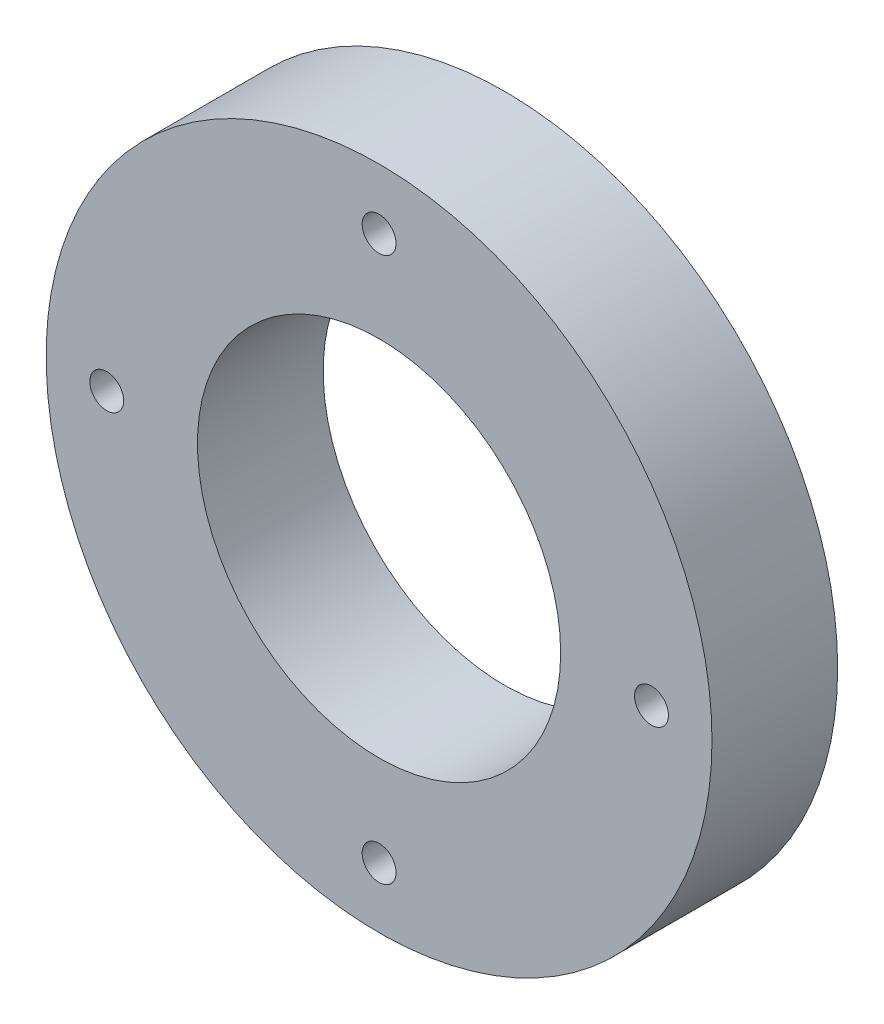
ISO-10303-21;
HEADER;
FILE_DESCRIPTION(('STEP AP214'),'2;1');
FILE_NAME('part.step','',(''),(''),'','','');
FILE_SCHEMA(('AUTOMOTIVE_DESIGN { 1 0 10303 214 1 1 1 1 }'));
ENDSEC;
DATA;
#1=APPLICATION_CONTEXT('core data for automotive mechanical design processes');
#2=APPLICATION_PROTOCOL_DEFINITION('international standard','automotive_design',2000,#1);
#3=PRODUCT_CONTEXT('',#1,'mechanical');
#4=PRODUCT('Part','Part','',(#3));
#5=PRODUCT_RELATED_PRODUCT_CATEGORY('part','',(#4));
#6=PRODUCT_DEFINITION_FORMATION('','',#4);
#7=PRODUCT_DEFINITION_CONTEXT('part definition',#1,'design');
#8=PRODUCT_DEFINITION('design','',#6,#7);
#9=PRODUCT_DEFINITION_SHAPE('','',#8);
#10=(LENGTH_UNIT() NAMED_UNIT(*) SI_UNIT(.MILLI.,.METRE.));
#11=(NAMED_UNIT(*) PLANE_ANGLE_UNIT() SI_UNIT($,.RADIAN.));
#12=(NAMED_UNIT(*) SI_UNIT($,.STERADIAN.) SOLID_ANGLE_UNIT());
#13=UNCERTAINTY_MEASURE_WITH_UNIT(LENGTH_MEASURE(1.E-05),#10,'distance_accuracy_value','');
#14=(GEOMETRIC_REPRESENTATION_CONTEXT(3) GLOBAL_UNCERTAINTY_ASSIGNED_CONTEXT((#13)) GLOBAL_UNIT_ASSIGNED_CONTEXT((#10,
#11,#12)) REPRESENTATION_CONTEXT('',''));
#15=CARTESIAN_POINT('',(0.,0.,0.));
#16=DIRECTION('',(0.,0.,1.));
#17=DIRECTION('',(1.,0.,0.));
#18=AXIS2_PLACEMENT_3D('',#15,#16,#17);
#19=CARTESIAN_POINT('',(0.,0.,13.1826));
#20=DIRECTION('',(0.,0.,1.));
#21=DIRECTION('',(1.,0.,0.));
#22=AXIS2_PLACEMENT_3D('',#19,#20,#21);
#23=PLANE('',#22);
#24=CARTESIAN_POINT('',(0.,-28.575,13.1826));
#25=DIRECTION('',(0.,0.,1.));
#26=DIRECTION('',(1.,0.,0.));
#27=AXIS2_PLACEMENT_3D('',#24,#25,#26);
#28=CIRCLE('',#27,1.778);
#29=CARTESIAN_POINT('',(1.778,-28.575,13.1826));
#30=VERTEX_POINT('',#29);
#31=EDGE_CURVE('E59',#30,#30,#28,.T.);
#32=ORIENTED_EDGE('',*,*,#31,.F.);
#33=EDGE_LOOP('',(#32));
#34=FACE_BOUND('',#33,.T.);
#35=CARTESIAN_POINT('',(0.,0.,13.1826));
#36=DIRECTION('',(0.,0.,1.));
#37=DIRECTION('',(1.,0.,0.));
#38=AXIS2_PLACEMENT_3D('',#35,#36,#37);
#39=CIRCLE('',#38,19.05);
#40=CARTESIAN_POINT('',(19.05,0.,13.1826));
#41=VERTEX_POINT('',#40);
#42=EDGE_CURVE('E47',#41,#41,#39,.T.);
#43=ORIENTED_EDGE('',*,*,#42,.F.);
#44=EDGE_LOOP('',(#43));
#45=FACE_BOUND('',#44,.T.);
#46=CARTESIAN_POINT('',(0.,0.,13.1826));
#47=DIRECTION('',(0.,0.,1.));
#48=DIRECTION('',(1.,0.,0.));
#49=AXIS2_PLACEMENT_3D('',#46,#47,#48);
#50=CIRCLE('',#49,34.925);
#51=CARTESIAN_POINT('',(34.925,0.,13.1826));
#52=VERTEX_POINT('',#51);
#53=EDGE_CURVE('E10',#52,#52,#50,.T.);
#54=ORIENTED_EDGE('',*,*,#53,.T.);
#55=EDGE_LOOP('',(#54));
#56=FACE_BOUND('',#55,.T.);
#57=CARTESIAN_POINT('',(0.,28.575,13.1826));
#58=DIRECTION('',(0.,0.,1.));
#59=DIRECTION('',(1.,0.,0.));
#60=AXIS2_PLACEMENT_3D('',#57,#58,#59);
#61=CIRCLE('',#60,1.778);
#62=CARTESIAN_POINT('',(1.778,28.575,13.1826));
#63=VERTEX_POINT('',#62);
#64=EDGE_CURVE('E42',#63,#63,#61,.T.);
#65=ORIENTED_EDGE('',*,*,#64,.F.);
#66=EDGE_LOOP('',(#65));
#67=FACE_BOUND('',#66,.T.);
#68=CARTESIAN_POINT('',(28.575,0.,13.1826));
#69=DIRECTION('',(0.,0.,1.));
#70=DIRECTION('',(1.,0.,0.));
#71=AXIS2_PLACEMENT_3D('',#68,#69,#70);
#72=CIRCLE('',#71,1.778);
#73=CARTESIAN_POINT('',(30.353,0.,13.1826));
#74=VERTEX_POINT('',#73);
#75=EDGE_CURVE('E53',#74,#74,#72,.T.);
#76=ORIENTED_EDGE('',*,*,#75,.F.);
#77=EDGE_LOOP('',(#76));
#78=FACE_BOUND('',#77,.T.);
#79=CARTESIAN_POINT('',(-28.575,0.,13.1826));
#80=DIRECTION('',(0.,0.,1.));
#81=DIRECTION('',(1.,0.,0.));
#82=AXIS2_PLACEMENT_3D('',#79,#80,#81);
#83=CIRCLE('',#82,1.77800000000001);
#84=CARTESIAN_POINT('',(-26.797,0.,13.1826));
#85=VERTEX_POINT('',#84);
#86=EDGE_CURVE('E65',#85,#85,#83,.T.);
#87=ORIENTED_EDGE('',*,*,#86,.F.);
#88=EDGE_LOOP('',(#87));
#89=FACE_BOUND('',#88,.T.);
#90=ADVANCED_FACE('F31',(#34,#45,#56,#67,#78,#89),#23,.T.);
#91=CARTESIAN_POINT('',(0.,0.,0.));
#92=DIRECTION('',(0.,0.,1.));
#93=DIRECTION('',(1.,0.,0.));
#94=AXIS2_PLACEMENT_3D('',#91,#92,#93);
#95=PLANE('',#94);
#96=CARTESIAN_POINT('',(0.,-28.575,0.));
#97=DIRECTION('',(0.,0.,1.));
#98=DIRECTION('',(1.,0.,0.));
#99=AXIS2_PLACEMENT_3D('',#96,#97,#98);
#100=CIRCLE('',#99,1.778);
#101=CARTESIAN_POINT('',(1.778,-28.575,0.));
#102=VERTEX_POINT('',#101);
#103=EDGE_CURVE('E62',#102,#102,#100,.T.);
#104=ORIENTED_EDGE('',*,*,#103,.T.);
#105=EDGE_LOOP('',(#104));
#106=FACE_BOUND('',#105,.T.);
#107=CARTESIAN_POINT('',(0.,0.,0.));
#108=DIRECTION('',(0.,0.,1.));
#109=DIRECTION('',(1.,0.,0.));
#110=AXIS2_PLACEMENT_3D('',#107,#108,#109);
#111=CIRCLE('',#110,19.05);
#112=CARTESIAN_POINT('',(19.05,0.,0.));
#113=VERTEX_POINT('',#112);
#114=EDGE_CURVE('E50',#113,#113,#111,.T.);
#115=ORIENTED_EDGE('',*,*,#114,.T.);
#116=EDGE_LOOP('',(#115));
#117=FACE_BOUND('',#116,.T.);
#118=CARTESIAN_POINT('',(0.,0.,0.));
#119=DIRECTION('',(0.,0.,1.));
#120=DIRECTION('',(1.,0.,0.));
#121=AXIS2_PLACEMENT_3D('',#118,#119,#120);
#122=CIRCLE('',#121,34.925);
#123=CARTESIAN_POINT('',(34.925,0.,0.));
#124=VERTEX_POINT('',#123);
#125=EDGE_CURVE('E35',#124,#124,#122,.T.);
#126=ORIENTED_EDGE('',*,*,#125,.F.);
#127=EDGE_LOOP('',(#126));
#128=FACE_BOUND('',#127,.T.);
#129=CARTESIAN_POINT('',(0.,28.575,0.));
#130=DIRECTION('',(0.,0.,1.));
#131=DIRECTION('',(1.,0.,0.));
#132=AXIS2_PLACEMENT_3D('',#129,#130,#131);
#133=CIRCLE('',#132,1.778);
#134=CARTESIAN_POINT('',(1.778,28.575,0.));
#135=VERTEX_POINT('',#134);
#136=EDGE_CURVE('E44',#135,#135,#133,.T.);
#137=ORIENTED_EDGE('',*,*,#136,.T.);
#138=EDGE_LOOP('',(#137));
#139=FACE_BOUND('',#138,.T.);
#140=CARTESIAN_POINT('',(28.575,0.,0.));
#141=DIRECTION('',(0.,0.,1.));
#142=DIRECTION('',(1.,0.,0.));
#143=AXIS2_PLACEMENT_3D('',#140,#141,#142);
#144=CIRCLE('',#143,1.778);
#145=CARTESIAN_POINT('',(30.353,0.,0.));
#146=VERTEX_POINT('',#145);
#147=EDGE_CURVE('E56',#146,#146,#144,.T.);
#148=ORIENTED_EDGE('',*,*,#147,.T.);
#149=EDGE_LOOP('',(#148));
#150=FACE_BOUND('',#149,.T.);
#151=CARTESIAN_POINT('',(-28.575,0.,0.));
#152=DIRECTION('',(0.,0.,1.));
#153=DIRECTION('',(1.,0.,0.));
#154=AXIS2_PLACEMENT_3D('',#151,#152,#153);
#155=CIRCLE('',#154,1.77800000000001);
#156=CARTESIAN_POINT('',(-26.797,0.,0.));
#157=VERTEX_POINT('',#156);
#158=EDGE_CURVE('E68',#157,#157,#155,.T.);
#159=ORIENTED_EDGE('',*,*,#158,.T.);
#160=EDGE_LOOP('',(#159));
#161=FACE_BOUND('',#160,.T.);
#162=ADVANCED_FACE('F78',(#106,#117,#128,#139,#150,#161),#95,.F.);
#163=CARTESIAN_POINT('',(0.,0.,13.1826));
#164=DIRECTION('',(0.,0.,-1.));
#165=DIRECTION('',(-1.,0.,0.));
#166=AXIS2_PLACEMENT_3D('',#163,#164,#165);
#167=CYLINDRICAL_SURFACE('',#166,34.925);
#168=ORIENTED_EDGE('',*,*,#53,.F.);
#169=EDGE_LOOP('',(#168));
#170=FACE_BOUND('',#169,.T.);
#171=ORIENTED_EDGE('',*,*,#125,.T.);
#172=EDGE_LOOP('',(#171));
#173=FACE_BOUND('',#172,.T.);
#174=ADVANCED_FACE('F33',(#170,#173),#167,.T.);
#175=CARTESIAN_POINT('',(0.,28.575,13.1826));
#176=DIRECTION('',(0.,0.,-1.));
#177=DIRECTION('',(-1.,0.,0.));
#178=AXIS2_PLACEMENT_3D('',#175,#176,#177);
#179=CYLINDRICAL_SURFACE('',#178,1.778);
#180=ORIENTED_EDGE('',*,*,#64,.T.);
#181=EDGE_LOOP('',(#180));
#182=FACE_BOUND('',#181,.T.);
#183=ORIENTED_EDGE('',*,*,#136,.F.);
#184=EDGE_LOOP('',(#183));
#185=FACE_BOUND('',#184,.T.);
#186=ADVANCED_FACE('F88',(#182,#185),#179,.F.);
#187=CARTESIAN_POINT('',(0.,0.,13.1826));
#188=DIRECTION('',(0.,0.,-1.));
#189=DIRECTION('',(-1.,0.,0.));
#190=AXIS2_PLACEMENT_3D('',#187,#188,#189);
#191=CYLINDRICAL_SURFACE('',#190,19.05);
#192=ORIENTED_EDGE('',*,*,#42,.T.);
#193=EDGE_LOOP('',(#192));
#194=FACE_BOUND('',#193,.T.);
#195=ORIENTED_EDGE('',*,*,#114,.F.);
#196=EDGE_LOOP('',(#195));
#197=FACE_BOUND('',#196,.T.);
#198=ADVANCED_FACE('F91',(#194,#197),#191,.F.);
#199=CARTESIAN_POINT('',(28.575,0.,13.1826));
#200=DIRECTION('',(0.,0.,-1.));
#201=DIRECTION('',(-1.,0.,0.));
#202=AXIS2_PLACEMENT_3D('',#199,#200,#201);
#203=CYLINDRICAL_SURFACE('',#202,1.778);
#204=ORIENTED_EDGE('',*,*,#75,.T.);
#205=EDGE_LOOP('',(#204));
#206=FACE_BOUND('',#205,.T.);
#207=ORIENTED_EDGE('',*,*,#147,.F.);
#208=EDGE_LOOP('',(#207));
#209=FACE_BOUND('',#208,.T.);
#210=ADVANCED_FACE('F95',(#206,#209),#203,.F.);
#211=CARTESIAN_POINT('',(0.,-28.575,13.1826));
#212=DIRECTION('',(0.,0.,-1.));
#213=DIRECTION('',(-1.,0.,0.));
#214=AXIS2_PLACEMENT_3D('',#211,#212,#213);
#215=CYLINDRICAL_SURFACE('',#214,1.778);
#216=ORIENTED_EDGE('',*,*,#31,.T.);
#217=EDGE_LOOP('',(#216));
#218=FACE_BOUND('',#217,.T.);
#219=ORIENTED_EDGE('',*,*,#103,.F.);
#220=EDGE_LOOP('',(#219));
#221=FACE_BOUND('',#220,.T.);
#222=ADVANCED_FACE('F99',(#218,#221),#215,.F.);
#223=CARTESIAN_POINT('',(-28.575,0.,13.1826));
#224=DIRECTION('',(0.,0.,-1.));
#225=DIRECTION('',(-1.,0.,0.));
#226=AXIS2_PLACEMENT_3D('',#223,#224,#225);
#227=CYLINDRICAL_SURFACE('',#226,1.77800000000001);
#228=ORIENTED_EDGE('',*,*,#86,.T.);
#229=EDGE_LOOP('',(#228));
#230=FACE_BOUND('',#229,.T.);
#231=ORIENTED_EDGE('',*,*,#158,.F.);
#232=EDGE_LOOP('',(#231));
#233=FACE_BOUND('',#232,.T.);
#234=ADVANCED_FACE('F74',(#230,#233),#227,.F.);
#235=CLOSED_SHELL('',(#90,#162,#174,#186,#198,#210,#222,#234));
#236=MANIFOLD_SOLID_BREP('B2',#235);
#237=ADVANCED_BREP_SHAPE_REPRESENTATION('',(#18,#236),#14);
#238=SHAPE_DEFINITION_REPRESENTATION(#9,#237);
ENDSEC;
END-ISO-10303-21;
